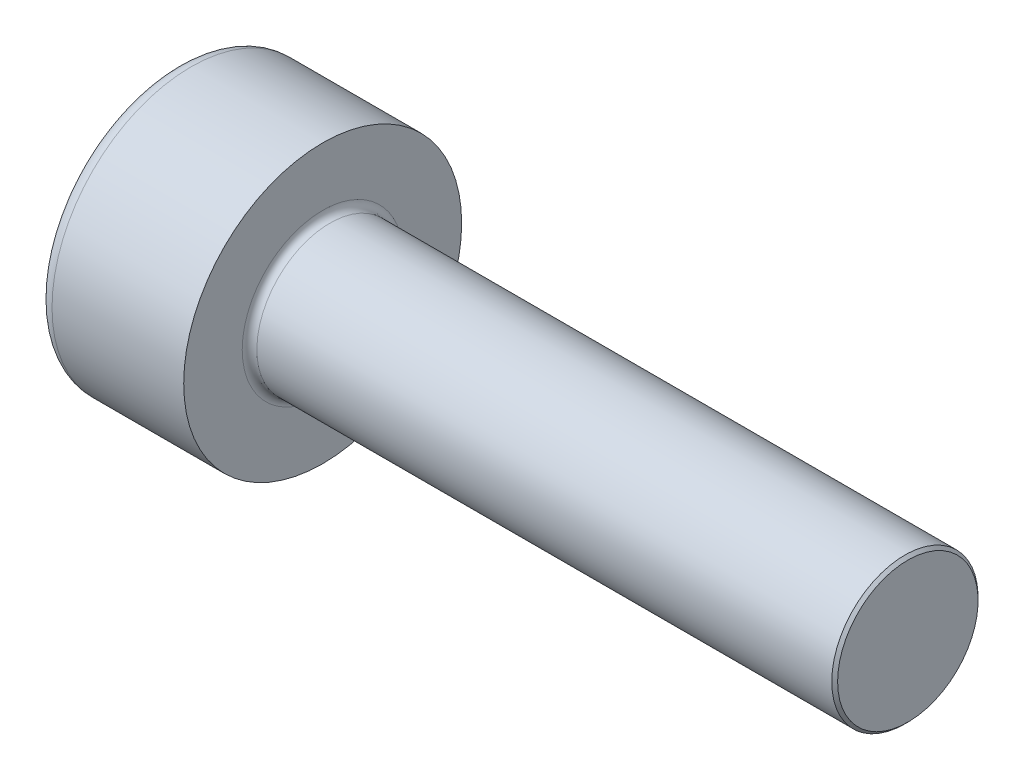
ISO-10303-21;
HEADER;
FILE_DESCRIPTION(('STEP AP214'),'2;1');
FILE_NAME('part.step','',(''),(''),'','','');
FILE_SCHEMA(('AUTOMOTIVE_DESIGN { 1 0 10303 214 1 1 1 1 }'));
ENDSEC;
DATA;
#1=APPLICATION_CONTEXT('core data for automotive mechanical design processes');
#2=APPLICATION_PROTOCOL_DEFINITION('international standard','automotive_design',2000,#1);
#3=PRODUCT_CONTEXT('',#1,'mechanical');
#4=PRODUCT('Part','Part','',(#3));
#5=PRODUCT_RELATED_PRODUCT_CATEGORY('part','',(#4));
#6=PRODUCT_DEFINITION_FORMATION('','',#4);
#7=PRODUCT_DEFINITION_CONTEXT('part definition',#1,'design');
#8=PRODUCT_DEFINITION('design','',#6,#7);
#9=PRODUCT_DEFINITION_SHAPE('','',#8);
#10=(LENGTH_UNIT() NAMED_UNIT(*) SI_UNIT(.MILLI.,.METRE.));
#11=(NAMED_UNIT(*) PLANE_ANGLE_UNIT() SI_UNIT($,.RADIAN.));
#12=(NAMED_UNIT(*) SI_UNIT($,.STERADIAN.) SOLID_ANGLE_UNIT());
#13=UNCERTAINTY_MEASURE_WITH_UNIT(LENGTH_MEASURE(1.E-05),#10,'distance_accuracy_value','');
#14=(GEOMETRIC_REPRESENTATION_CONTEXT(3) GLOBAL_UNCERTAINTY_ASSIGNED_CONTEXT((#13)) GLOBAL_UNIT_ASSIGNED_CONTEXT((#10,
#11,#12)) REPRESENTATION_CONTEXT('',''));
#15=CARTESIAN_POINT('',(0.,0.,0.));
#16=DIRECTION('',(0.,0.,1.));
#17=DIRECTION('',(1.,0.,0.));
#18=AXIS2_PLACEMENT_3D('',#15,#16,#17);
#19=CARTESIAN_POINT('',(-0.999999999976353,0.,0.));
#20=DIRECTION('',(-1.,0.,0.));
#21=DIRECTION('',(0.,0.,1.));
#22=AXIS2_PLACEMENT_3D('',#19,#20,#21);
#23=CONICAL_SURFACE('',#22,0.866500000029191,1.04719755115174);
#24=CARTESIAN_POINT('',(-0.499725991687683,0.,0.));
#25=VERTEX_POINT('',#24);
#26=VERTEX_LOOP('',#25);
#27=FACE_BOUND('',#26,.T.);
#28=CARTESIAN_POINT('',(-0.999999999976353,0.,0.));
#29=DIRECTION('',(-1.,0.,0.));
#30=DIRECTION('',(0.,0.,1.));
#31=AXIS2_PLACEMENT_3D('',#28,#29,#30);
#32=CIRCLE('',#31,0.866500000029191);
#33=CARTESIAN_POINT('',(-0.999999999927125,0.433249999985406,-0.750411012404495));
#34=VERTEX_POINT('',#33);
#35=CARTESIAN_POINT('',(-0.999999999976353,-0.433250000014597,-0.750411012404496));
#36=VERTEX_POINT('',#35);
#37=EDGE_CURVE('E148',#34,#36,#32,.T.);
#38=ORIENTED_EDGE('',*,*,#37,.T.);
#39=CARTESIAN_POINT('',(-0.999999999976353,0.,0.));
#40=DIRECTION('',(-1.,0.,0.));
#41=DIRECTION('',(0.,0.,1.));
#42=AXIS2_PLACEMENT_3D('',#39,#40,#41);
#43=CIRCLE('',#42,0.866500000029191);
#44=CARTESIAN_POINT('',(-0.999999999976353,-0.866500000029192,0.));
#45=VERTEX_POINT('',#44);
#46=EDGE_CURVE('E59',#36,#45,#43,.T.);
#47=ORIENTED_EDGE('',*,*,#46,.T.);
#48=CARTESIAN_POINT('',(-0.999999999976353,0.,0.));
#49=DIRECTION('',(-1.,0.,0.));
#50=DIRECTION('',(0.,0.,1.));
#51=AXIS2_PLACEMENT_3D('',#48,#49,#50);
#52=CIRCLE('',#51,0.866500000029191);
#53=CARTESIAN_POINT('',(-0.999999999976353,-0.433250000014596,0.750411012404497));
#54=VERTEX_POINT('',#53);
#55=EDGE_CURVE('E20',#45,#54,#52,.T.);
#56=ORIENTED_EDGE('',*,*,#55,.T.);
#57=CARTESIAN_POINT('',(-0.999999999976353,0.,0.));
#58=DIRECTION('',(-1.,0.,0.));
#59=DIRECTION('',(0.,0.,1.));
#60=AXIS2_PLACEMENT_3D('',#57,#58,#59);
#61=CIRCLE('',#60,0.866500000029191);
#62=CARTESIAN_POINT('',(-0.999999999845079,0.433249999900906,0.750411012207586));
#63=VERTEX_POINT('',#62);
#64=EDGE_CURVE('E153',#54,#63,#61,.T.);
#65=ORIENTED_EDGE('',*,*,#64,.T.);
#66=CARTESIAN_POINT('',(-0.999999999845079,0.,0.));
#67=DIRECTION('',(-1.,0.,0.));
#68=DIRECTION('',(0.,0.,1.));
#69=AXIS2_PLACEMENT_3D('',#66,#67,#68);
#70=CIRCLE('',#69,0.866499999801817);
#71=CARTESIAN_POINT('',(-0.999999999845079,0.866499999801817,0.));
#72=VERTEX_POINT('',#71);
#73=EDGE_CURVE('E152',#63,#72,#70,.T.);
#74=ORIENTED_EDGE('',*,*,#73,.T.);
#75=CARTESIAN_POINT('',(-0.999999999976353,0.,0.));
#76=DIRECTION('',(-1.,0.,0.));
#77=DIRECTION('',(0.,0.,1.));
#78=AXIS2_PLACEMENT_3D('',#75,#76,#77);
#79=CIRCLE('',#78,0.866500000029191);
#80=EDGE_CURVE('E150',#72,#34,#79,.T.);
#81=ORIENTED_EDGE('',*,*,#80,.T.);
#82=EDGE_LOOP('',(#38,#47,#56,#65,#74,#81));
#83=FACE_BOUND('',#82,.T.);
#84=ADVANCED_FACE('F16',(#27,#83),#23,.F.);
#85=CARTESIAN_POINT('',(-0.999999999999996,0.,0.));
#86=DIRECTION('',(-1.,0.,0.));
#87=DIRECTION('',(0.,-1.,0.));
#88=AXIS2_PLACEMENT_3D('',#85,#86,#87);
#89=PLANE('',#88);
#90=DIRECTION('',(0.,-0.500000000000001,-0.866025403784438));
#91=VECTOR('',#90,1.);
#92=CARTESIAN_POINT('',(-0.999999999988174,-0.866500000000001,0.));
#93=LINE('',#92,#91);
#94=EDGE_CURVE('E128',#45,#54,#93,.F.);
#95=ORIENTED_EDGE('',*,*,#94,.T.);
#96=ORIENTED_EDGE('',*,*,#55,.F.);
#97=EDGE_LOOP('',(#95,#96));
#98=FACE_BOUND('',#97,.T.);
#99=ADVANCED_FACE('F158',(#98),#89,.F.);
#100=CARTESIAN_POINT('',(-0.999999999999996,0.,0.));
#101=DIRECTION('',(-1.,0.,0.));
#102=DIRECTION('',(0.,-1.,0.));
#103=AXIS2_PLACEMENT_3D('',#100,#101,#102);
#104=PLANE('',#103);
#105=DIRECTION('',(0.,1.,0.));
#106=VECTOR('',#105,1.);
#107=CARTESIAN_POINT('',(-0.999999999976353,-0.433250000000001,0.750411012379219));
#108=LINE('',#107,#106);
#109=EDGE_CURVE('E106',#54,#63,#108,.T.);
#110=ORIENTED_EDGE('',*,*,#109,.T.);
#111=ORIENTED_EDGE('',*,*,#64,.F.);
#112=EDGE_LOOP('',(#110,#111));
#113=FACE_BOUND('',#112,.T.);
#114=ADVANCED_FACE('F162',(#113),#104,.F.);
#115=CARTESIAN_POINT('',(-0.999999999999996,0.,0.));
#116=DIRECTION('',(-1.,0.,0.));
#117=DIRECTION('',(0.,-1.,0.));
#118=AXIS2_PLACEMENT_3D('',#115,#116,#117);
#119=PLANE('',#118);
#120=DIRECTION('',(0.,-0.5,0.866025403784439));
#121=VECTOR('',#120,1.);
#122=CARTESIAN_POINT('',(-0.999999999877898,0.433249999999998,0.750411012379219));
#123=LINE('',#122,#121);
#124=EDGE_CURVE('E105',#63,#72,#123,.F.);
#125=ORIENTED_EDGE('',*,*,#124,.T.);
#126=ORIENTED_EDGE('',*,*,#73,.F.);
#127=EDGE_LOOP('',(#125,#126));
#128=FACE_BOUND('',#127,.T.);
#129=ADVANCED_FACE('F164',(#128),#119,.F.);
#130=CARTESIAN_POINT('',(-0.999999999999996,0.,0.));
#131=DIRECTION('',(-1.,0.,0.));
#132=DIRECTION('',(0.,-1.,0.));
#133=AXIS2_PLACEMENT_3D('',#130,#131,#132);
#134=PLANE('',#133);
#135=DIRECTION('',(0.,0.499999999999999,0.866025403784439));
#136=VECTOR('',#135,1.);
#137=CARTESIAN_POINT('',(-0.999999999877898,0.866499999999999,0.));
#138=LINE('',#137,#136);
#139=EDGE_CURVE('E230',#72,#34,#138,.F.);
#140=ORIENTED_EDGE('',*,*,#139,.T.);
#141=ORIENTED_EDGE('',*,*,#80,.F.);
#142=EDGE_LOOP('',(#140,#141));
#143=FACE_BOUND('',#142,.T.);
#144=ADVANCED_FACE('F171',(#143),#134,.F.);
#145=CARTESIAN_POINT('',(-0.999999999999996,0.,0.));
#146=DIRECTION('',(-1.,0.,0.));
#147=DIRECTION('',(0.,-1.,0.));
#148=AXIS2_PLACEMENT_3D('',#145,#146,#147);
#149=PLANE('',#148);
#150=DIRECTION('',(0.,1.,0.));
#151=VECTOR('',#150,1.);
#152=CARTESIAN_POINT('',(-0.999999999976353,0.433250000000001,-0.750411012379215));
#153=LINE('',#152,#151);
#154=EDGE_CURVE('E214',#34,#36,#153,.F.);
#155=ORIENTED_EDGE('',*,*,#154,.T.);
#156=ORIENTED_EDGE('',*,*,#37,.F.);
#157=EDGE_LOOP('',(#155,#156));
#158=FACE_BOUND('',#157,.T.);
#159=ADVANCED_FACE('F249',(#158),#149,.F.);
#160=CARTESIAN_POINT('',(-0.999999999999996,0.,0.));
#161=DIRECTION('',(-1.,0.,0.));
#162=DIRECTION('',(0.,-1.,0.));
#163=AXIS2_PLACEMENT_3D('',#160,#161,#162);
#164=PLANE('',#163);
#165=DIRECTION('',(0.,0.5,-0.866025403784439));
#166=VECTOR('',#165,1.);
#167=CARTESIAN_POINT('',(-0.999999999976353,-0.43325,-0.750411012379213));
#168=LINE('',#167,#166);
#169=EDGE_CURVE('E213',#36,#45,#168,.F.);
#170=ORIENTED_EDGE('',*,*,#169,.T.);
#171=ORIENTED_EDGE('',*,*,#46,.F.);
#172=EDGE_LOOP('',(#170,#171));
#173=FACE_BOUND('',#172,.T.);
#174=ADVANCED_FACE('F256',(#173),#164,.F.);
#175=CARTESIAN_POINT('',(-0.999999999999996,-0.866500000000001,0.));
#176=DIRECTION('',(0.,-0.866025403784438,0.500000000000001));
#177=DIRECTION('',(0.,-0.500000000000001,-0.866025403784438));
#178=AXIS2_PLACEMENT_3D('',#175,#176,#177);
#179=PLANE('',#178);
#180=ORIENTED_EDGE('',*,*,#94,.F.);
#181=DIRECTION('',(1.,0.,0.));
#182=VECTOR('',#181,1.);
#183=CARTESIAN_POINT('',(-0.999999999999996,-0.866500000015218,2.63620505633333E-11));
#184=LINE('',#183,#182);
#185=CARTESIAN_POINT('',(-2.,-0.866500000003807,6.5917719022568E-12));
#186=VERTEX_POINT('',#185);
#187=EDGE_CURVE('E68',#45,#186,#184,.F.);
#188=ORIENTED_EDGE('',*,*,#187,.T.);
#189=DIRECTION('',(0.,0.500000000000001,0.866025403784438));
#190=VECTOR('',#189,1.);
#191=CARTESIAN_POINT('',(-2.,-0.866500000000003,0.));
#192=LINE('',#191,#190);
#193=CARTESIAN_POINT('',(-2.,-0.433249999998178,0.750411012379218));
#194=VERTEX_POINT('',#193);
#195=EDGE_CURVE('E97',#186,#194,#192,.T.);
#196=ORIENTED_EDGE('',*,*,#195,.T.);
#197=DIRECTION('',(1.,0.,0.));
#198=VECTOR('',#197,1.);
#199=CARTESIAN_POINT('',(-0.999999999999996,-0.433250000000002,0.750411012379219));
#200=LINE('',#199,#198);
#201=EDGE_CURVE('E92',#194,#54,#200,.T.);
#202=ORIENTED_EDGE('',*,*,#201,.T.);
#203=EDGE_LOOP('',(#180,#188,#196,#202));
#204=FACE_BOUND('',#203,.T.);
#205=ADVANCED_FACE('F160',(#204),#179,.F.);
#206=CARTESIAN_POINT('',(-0.999999999999996,-0.433250000000001,0.750411012379219));
#207=DIRECTION('',(0.,0.,1.));
#208=DIRECTION('',(1.,0.,0.));
#209=AXIS2_PLACEMENT_3D('',#206,#207,#208);
#210=PLANE('',#209);
#211=ORIENTED_EDGE('',*,*,#109,.F.);
#212=ORIENTED_EDGE('',*,*,#201,.F.);
#213=DIRECTION('',(0.,1.,0.));
#214=VECTOR('',#213,1.);
#215=CARTESIAN_POINT('',(-2.,0.866499999999999,0.750411012379217));
#216=LINE('',#215,#214);
#217=CARTESIAN_POINT('',(-2.,0.43324999999558,0.750411012386869));
#218=VERTEX_POINT('',#217);
#219=EDGE_CURVE('E85',#194,#218,#216,.T.);
#220=ORIENTED_EDGE('',*,*,#219,.T.);
#221=DIRECTION('',(1.,0.,0.));
#222=VECTOR('',#221,1.);
#223=CARTESIAN_POINT('',(-0.999999999999996,0.433249999999997,0.75041101237922));
#224=LINE('',#223,#222);
#225=EDGE_CURVE('E89',#218,#63,#224,.T.);
#226=ORIENTED_EDGE('',*,*,#225,.T.);
#227=EDGE_LOOP('',(#211,#212,#220,#226));
#228=FACE_BOUND('',#227,.T.);
#229=ADVANCED_FACE('F88',(#228),#210,.F.);
#230=CARTESIAN_POINT('',(-0.999999999999996,0.433249999999998,0.750411012379219));
#231=DIRECTION('',(0.,0.866025403784439,0.5));
#232=DIRECTION('',(0.,-0.5,0.866025403784439));
#233=AXIS2_PLACEMENT_3D('',#230,#231,#232);
#234=PLANE('',#233);
#235=ORIENTED_EDGE('',*,*,#124,.F.);
#236=ORIENTED_EDGE('',*,*,#225,.F.);
#237=DIRECTION('',(0.,0.500000000000001,-0.866025403784438));
#238=VECTOR('',#237,1.);
#239=CARTESIAN_POINT('',(-2.,0.433249999999996,0.750411012379219));
#240=LINE('',#239,#238);
#241=CARTESIAN_POINT('',(-2.,0.866500000004416,7.65015825891357E-12));
#242=VERTEX_POINT('',#241);
#243=EDGE_CURVE('E96',#218,#242,#240,.T.);
#244=ORIENTED_EDGE('',*,*,#243,.T.);
#245=DIRECTION('',(1.,0.,0.));
#246=VECTOR('',#245,1.);
#247=CARTESIAN_POINT('',(-0.999999999999996,0.866499999999999,0.));
#248=LINE('',#247,#246);
#249=EDGE_CURVE('E234',#242,#72,#248,.T.);
#250=ORIENTED_EDGE('',*,*,#249,.T.);
#251=EDGE_LOOP('',(#235,#236,#244,#250));
#252=FACE_BOUND('',#251,.T.);
#253=ADVANCED_FACE('F101',(#252),#234,.F.);
#254=CARTESIAN_POINT('',(-0.999999999999996,0.866499999999999,0.));
#255=DIRECTION('',(0.,0.866025403784439,-0.499999999999999));
#256=DIRECTION('',(0.,0.499999999999999,0.866025403784439));
#257=AXIS2_PLACEMENT_3D('',#254,#255,#256);
#258=PLANE('',#257);
#259=ORIENTED_EDGE('',*,*,#139,.F.);
#260=ORIENTED_EDGE('',*,*,#249,.F.);
#261=DIRECTION('',(0.,-0.499999999999999,-0.866025403784439));
#262=VECTOR('',#261,1.);
#263=CARTESIAN_POINT('',(-2.,0.866499999999999,0.));
#264=LINE('',#263,#262);
#265=CARTESIAN_POINT('',(-2.,0.433249999998177,-0.750411012379215));
#266=VERTEX_POINT('',#265);
#267=EDGE_CURVE('E112',#242,#266,#264,.T.);
#268=ORIENTED_EDGE('',*,*,#267,.T.);
#269=DIRECTION('',(1.,0.,0.));
#270=VECTOR('',#269,1.);
#271=CARTESIAN_POINT('',(-0.999999999999996,0.433250000000002,-0.750411012379215));
#272=LINE('',#271,#270);
#273=EDGE_CURVE('E221',#266,#34,#272,.T.);
#274=ORIENTED_EDGE('',*,*,#273,.T.);
#275=EDGE_LOOP('',(#259,#260,#268,#274));
#276=FACE_BOUND('',#275,.T.);
#277=ADVANCED_FACE('F245',(#276),#258,.F.);
#278=CARTESIAN_POINT('',(-0.999999999999996,0.433250000000001,-0.750411012379215));
#279=DIRECTION('',(0.,0.,-1.));
#280=DIRECTION('',(0.,1.,0.));
#281=AXIS2_PLACEMENT_3D('',#278,#279,#280);
#282=PLANE('',#281);
#283=ORIENTED_EDGE('',*,*,#154,.F.);
#284=ORIENTED_EDGE('',*,*,#273,.F.);
#285=DIRECTION('',(0.,1.,0.));
#286=VECTOR('',#285,1.);
#287=CARTESIAN_POINT('',(-2.,0.866499999999999,-0.750411012379215));
#288=LINE('',#287,#286);
#289=CARTESIAN_POINT('',(-2.,-0.43325,-0.750411012379212));
#290=VERTEX_POINT('',#289);
#291=EDGE_CURVE('E114',#266,#290,#288,.F.);
#292=ORIENTED_EDGE('',*,*,#291,.T.);
#293=DIRECTION('',(1.,0.,0.));
#294=VECTOR('',#293,1.);
#295=CARTESIAN_POINT('',(-0.999999999999996,-0.43325,-0.750411012379212));
#296=LINE('',#295,#294);
#297=EDGE_CURVE('E210',#290,#36,#296,.T.);
#298=ORIENTED_EDGE('',*,*,#297,.T.);
#299=EDGE_LOOP('',(#283,#284,#292,#298));
#300=FACE_BOUND('',#299,.T.);
#301=ADVANCED_FACE('F250',(#300),#282,.F.);
#302=CARTESIAN_POINT('',(-0.999999999999996,-0.43325,-0.750411012379213));
#303=DIRECTION('',(0.,-0.866025403784439,-0.5));
#304=DIRECTION('',(0.,0.5,-0.866025403784439));
#305=AXIS2_PLACEMENT_3D('',#302,#303,#304);
#306=PLANE('',#305);
#307=ORIENTED_EDGE('',*,*,#169,.F.);
#308=ORIENTED_EDGE('',*,*,#297,.F.);
#309=DIRECTION('',(0.,-0.500000000000001,0.866025403784438));
#310=VECTOR('',#309,1.);
#311=CARTESIAN_POINT('',(-2.,-0.433250000000002,-0.750411012379213));
#312=LINE('',#311,#310);
#313=EDGE_CURVE('E146',#290,#186,#312,.T.);
#314=ORIENTED_EDGE('',*,*,#313,.T.);
#315=ORIENTED_EDGE('',*,*,#187,.F.);
#316=EDGE_LOOP('',(#307,#308,#314,#315));
#317=FACE_BOUND('',#316,.T.);
#318=ADVANCED_FACE('F257',(#317),#306,.F.);
#319=CARTESIAN_POINT('',(-2.,0.866499999999999,0.));
#320=DIRECTION('',(1.,0.,0.));
#321=DIRECTION('',(0.,1.,0.));
#322=AXIS2_PLACEMENT_3D('',#319,#320,#321);
#323=PLANE('',#322);
#324=ORIENTED_EDGE('',*,*,#291,.F.);
#325=ORIENTED_EDGE('',*,*,#267,.F.);
#326=ORIENTED_EDGE('',*,*,#243,.F.);
#327=ORIENTED_EDGE('',*,*,#219,.F.);
#328=ORIENTED_EDGE('',*,*,#195,.F.);
#329=ORIENTED_EDGE('',*,*,#313,.F.);
#330=EDGE_LOOP('',(#324,#325,#326,#327,#328,#329));
#331=FACE_BOUND('',#330,.T.);
#332=CARTESIAN_POINT('',(-2.,0.,0.));
#333=DIRECTION('',(-1.,0.,0.));
#334=DIRECTION('',(0.,0.,1.));
#335=AXIS2_PLACEMENT_3D('',#332,#333,#334);
#336=CIRCLE('',#335,1.7);
#337=CARTESIAN_POINT('',(-2.,0.,1.7));
#338=VERTEX_POINT('',#337);
#339=EDGE_CURVE('E143',#338,#338,#336,.F.);
#340=ORIENTED_EDGE('',*,*,#339,.F.);
#341=EDGE_LOOP('',(#340));
#342=FACE_BOUND('',#341,.T.);
#343=ADVANCED_FACE('F110',(#331,#342),#323,.F.);
#344=CARTESIAN_POINT('',(-1.8,0.,0.));
#345=DIRECTION('',(-1.,0.,0.));
#346=DIRECTION('',(0.,0.,1.));
#347=AXIS2_PLACEMENT_3D('',#344,#345,#346);
#348=TOROIDAL_SURFACE('',#347,1.7,0.200000000000001);
#349=ORIENTED_EDGE('',*,*,#339,.T.);
#350=EDGE_LOOP('',(#349));
#351=FACE_BOUND('',#350,.T.);
#352=CARTESIAN_POINT('',(-1.8,0.,0.));
#353=DIRECTION('',(-1.,0.,0.));
#354=DIRECTION('',(0.,-1.,0.));
#355=AXIS2_PLACEMENT_3D('',#352,#353,#354);
#356=CIRCLE('',#355,1.9);
#357=CARTESIAN_POINT('',(-1.8,-1.9,0.));
#358=VERTEX_POINT('',#357);
#359=EDGE_CURVE('E142',#358,#358,#356,.F.);
#360=ORIENTED_EDGE('',*,*,#359,.F.);
#361=EDGE_LOOP('',(#360));
#362=FACE_BOUND('',#361,.T.);
#363=ADVANCED_FACE('F264',(#351,#362),#348,.T.);
#364=CARTESIAN_POINT('',(-0.499725991747188,0.,0.));
#365=DIRECTION('',(-1.,0.,0.));
#366=DIRECTION('',(0.,-1.,0.));
#367=AXIS2_PLACEMENT_3D('',#364,#365,#366);
#368=CYLINDRICAL_SURFACE('',#367,1.9);
#369=ORIENTED_EDGE('',*,*,#359,.T.);
#370=EDGE_LOOP('',(#369));
#371=FACE_BOUND('',#370,.T.);
#372=CARTESIAN_POINT('',(0.,0.,0.));
#373=DIRECTION('',(-1.,0.,0.));
#374=DIRECTION('',(0.,-1.,0.));
#375=AXIS2_PLACEMENT_3D('',#372,#373,#374);
#376=CIRCLE('',#375,1.9);
#377=CARTESIAN_POINT('',(0.,-1.9,0.));
#378=VERTEX_POINT('',#377);
#379=EDGE_CURVE('E139',#378,#378,#376,.T.);
#380=ORIENTED_EDGE('',*,*,#379,.T.);
#381=EDGE_LOOP('',(#380));
#382=FACE_BOUND('',#381,.T.);
#383=ADVANCED_FACE('F337',(#371,#382),#368,.T.);
#384=CARTESIAN_POINT('',(8.00000000000001,0.96000000000001,0.));
#385=DIRECTION('',(-1.,0.,0.));
#386=DIRECTION('',(0.,-1.,0.));
#387=AXIS2_PLACEMENT_3D('',#384,#385,#386);
#388=PLANE('',#387);
#389=CARTESIAN_POINT('',(8.0000000000382,0.,0.));
#390=DIRECTION('',(-1.,0.,0.));
#391=DIRECTION('',(0.,0.,1.));
#392=AXIS2_PLACEMENT_3D('',#389,#390,#391);
#393=CIRCLE('',#392,0.959999999963657);
#394=CARTESIAN_POINT('',(8.0000000000382,0.,0.959999999963657));
#395=VERTEX_POINT('',#394);
#396=EDGE_CURVE('E135',#395,#395,#393,.T.);
#397=ORIENTED_EDGE('',*,*,#396,.F.);
#398=EDGE_LOOP('',(#397));
#399=FACE_BOUND('',#398,.T.);
#400=ADVANCED_FACE('F193',(#399),#388,.F.);
#401=CARTESIAN_POINT('',(0.,1.9,0.));
#402=DIRECTION('',(-1.,0.,0.));
#403=DIRECTION('',(0.,-1.,0.));
#404=AXIS2_PLACEMENT_3D('',#401,#402,#403);
#405=PLANE('',#404);
#406=ORIENTED_EDGE('',*,*,#379,.F.);
#407=EDGE_LOOP('',(#406));
#408=FACE_BOUND('',#407,.T.);
#409=CARTESIAN_POINT('',(0.,0.,0.));
#410=DIRECTION('',(-1.,0.,0.));
#411=DIRECTION('',(0.,-1.,0.));
#412=AXIS2_PLACEMENT_3D('',#409,#410,#411);
#413=CIRCLE('',#412,1.1);
#414=CARTESIAN_POINT('',(0.,-1.1,0.));
#415=VERTEX_POINT('',#414);
#416=CARTESIAN_POINT('',(0.,1.1,0.));
#417=VERTEX_POINT('',#416);
#418=EDGE_CURVE('E34',#415,#417,#413,.T.);
#419=ORIENTED_EDGE('',*,*,#418,.T.);
#420=CARTESIAN_POINT('',(0.,-1.1,0.));
#421=CARTESIAN_POINT('',(0.,-1.1,-0.209291554404422));
#422=CARTESIAN_POINT('',(0.,-1.02276713116867,-0.40490418051806));
#423=CARTESIAN_POINT('',(0.,-0.939479248699607,-0.615852726904439));
#424=CARTESIAN_POINT('',(0.,-0.777817459305204,-0.777817459305202));
#425=CARTESIAN_POINT('',(0.,-0.617594709836272,-0.938340455119255));
#426=CARTESIAN_POINT('',(0.,-0.404904180518061,-1.02276713116867));
#427=CARTESIAN_POINT('',(0.,-0.210832372192205,-1.09980317853935));
#428=CARTESIAN_POINT('',(0.,0.,-1.1));
#429=CARTESIAN_POINT('',(0.,0.208800774986567,-1.10019492487368));
#430=CARTESIAN_POINT('',(0.,0.404904180518063,-1.02276713116867));
#431=CARTESIAN_POINT('',(0.,0.615854782036777,-0.93947719741117));
#432=CARTESIAN_POINT('',(0.,0.777817459305204,-0.777817459305201));
#433=CARTESIAN_POINT('',(0.,0.938340455119269,-0.617594709836327));
#434=CARTESIAN_POINT('',(0.,1.02276713116867,-0.404904180518059));
#435=CARTESIAN_POINT('',(0.,1.1,-0.210336532931289));
#436=CARTESIAN_POINT('',(0.,1.1,0.));
#437=B_SPLINE_CURVE_WITH_KNOTS('',2,(#420,#421,#422,#423,#424,#425,#426,#427,#428,#429,#430,
#431,#432,#433,#434,#435,#436),.UNSPECIFIED.,.F.,.F.,(3,2,2,2,2,2,2,2,3),(0.,0.125,0.25,0.375,
0.5,0.625,0.75,0.875,1.),.UNSPECIFIED.);
#438=EDGE_CURVE('E138',#417,#415,#437,.F.);
#439=ORIENTED_EDGE('',*,*,#438,.T.);
#440=EDGE_LOOP('',(#419,#439));
#441=FACE_BOUND('',#440,.T.);
#442=ADVANCED_FACE('F188',(#408,#441),#405,.F.);
#443=CARTESIAN_POINT('',(7.96000000013919,0.,0.));
#444=DIRECTION('',(-1.,0.,0.));
#445=DIRECTION('',(0.,0.,1.));
#446=AXIS2_PLACEMENT_3D('',#443,#444,#445);
#447=CONICAL_SURFACE('',#446,0.999999999862666,0.785398163397448);
#448=ORIENTED_EDGE('',*,*,#396,.T.);
#449=EDGE_LOOP('',(#448));
#450=FACE_BOUND('',#449,.T.);
#451=CARTESIAN_POINT('',(7.96000000000008,0.,0.));
#452=DIRECTION('',(-1.,0.,0.));
#453=DIRECTION('',(0.,-1.,0.));
#454=AXIS2_PLACEMENT_3D('',#451,#452,#453);
#455=CIRCLE('',#454,1.);
#456=CARTESIAN_POINT('',(7.96000000000008,-1.,0.));
#457=VERTEX_POINT('',#456);
#458=EDGE_CURVE('E26',#457,#457,#455,.T.);
#459=ORIENTED_EDGE('',*,*,#458,.F.);
#460=EDGE_LOOP('',(#459));
#461=FACE_BOUND('',#460,.T.);
#462=ADVANCED_FACE('F182',(#450,#461),#447,.T.);
#463=CARTESIAN_POINT('',(0.100000000000003,0.,0.));
#464=DIRECTION('',(-1.,0.,0.));
#465=DIRECTION('',(0.,-1.,0.));
#466=AXIS2_PLACEMENT_3D('',#463,#464,#465);
#467=TOROIDAL_SURFACE('',#466,1.1,0.0999999999999996);
#468=ORIENTED_EDGE('',*,*,#418,.F.);
#469=ORIENTED_EDGE('',*,*,#438,.F.);
#470=EDGE_LOOP('',(#468,#469));
#471=FACE_BOUND('',#470,.T.);
#472=CARTESIAN_POINT('',(0.100000000000003,0.,0.));
#473=DIRECTION('',(-1.,0.,0.));
#474=DIRECTION('',(0.,-1.,0.));
#475=AXIS2_PLACEMENT_3D('',#472,#473,#474);
#476=CIRCLE('',#475,1.);
#477=CARTESIAN_POINT('',(0.100000000000003,-1.,0.));
#478=VERTEX_POINT('',#477);
#479=EDGE_CURVE('E11',#478,#478,#476,.F.);
#480=ORIENTED_EDGE('',*,*,#479,.F.);
#481=EDGE_LOOP('',(#480));
#482=FACE_BOUND('',#481,.T.);
#483=ADVANCED_FACE('F18',(#471,#482),#467,.F.);
#484=CARTESIAN_POINT('',(-0.499725991747188,0.,0.));
#485=DIRECTION('',(-1.,0.,0.));
#486=DIRECTION('',(0.,-1.,0.));
#487=AXIS2_PLACEMENT_3D('',#484,#485,#486);
#488=CYLINDRICAL_SURFACE('',#487,1.);
#489=ORIENTED_EDGE('',*,*,#479,.T.);
#490=EDGE_LOOP('',(#489));
#491=FACE_BOUND('',#490,.T.);
#492=ORIENTED_EDGE('',*,*,#458,.T.);
#493=EDGE_LOOP('',(#492));
#494=FACE_BOUND('',#493,.T.);
#495=ADVANCED_FACE('F175',(#491,#494),#488,.T.);
#496=CLOSED_SHELL('',(#84,#99,#114,#129,#144,#159,#174,#205,#229,#253,#277,#301,#318,#343,#363,
#383,#400,#442,#462,#483,#495));
#497=MANIFOLD_SOLID_BREP('B1',#496);
#498=ADVANCED_BREP_SHAPE_REPRESENTATION('',(#18,#497),#14);
#499=SHAPE_DEFINITION_REPRESENTATION(#9,#498);
ENDSEC;
END-ISO-10303-21;
